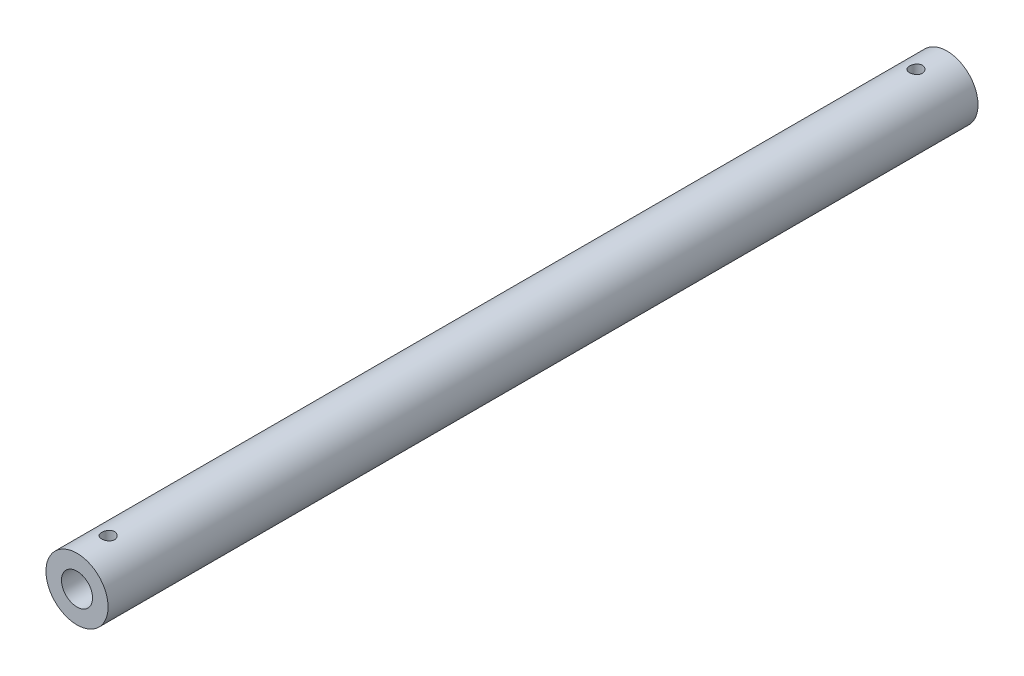
ISO-10303-21;
HEADER;
FILE_DESCRIPTION(('STEP AP214'),'2;1');
FILE_NAME('part.step','',(''),(''),'','','');
FILE_SCHEMA(('AUTOMOTIVE_DESIGN { 1 0 10303 214 1 1 1 1 }'));
ENDSEC;
DATA;
#1=APPLICATION_CONTEXT('core data for automotive mechanical design processes');
#2=APPLICATION_PROTOCOL_DEFINITION('international standard','automotive_design',2000,#1);
#3=PRODUCT_CONTEXT('',#1,'mechanical');
#4=PRODUCT('Part','Part','',(#3));
#5=PRODUCT_RELATED_PRODUCT_CATEGORY('part','',(#4));
#6=PRODUCT_DEFINITION_FORMATION('','',#4);
#7=PRODUCT_DEFINITION_CONTEXT('part definition',#1,'design');
#8=PRODUCT_DEFINITION('design','',#6,#7);
#9=PRODUCT_DEFINITION_SHAPE('','',#8);
#10=(LENGTH_UNIT() NAMED_UNIT(*) SI_UNIT(.MILLI.,.METRE.));
#11=(NAMED_UNIT(*) PLANE_ANGLE_UNIT() SI_UNIT($,.RADIAN.));
#12=(NAMED_UNIT(*) SI_UNIT($,.STERADIAN.) SOLID_ANGLE_UNIT());
#13=UNCERTAINTY_MEASURE_WITH_UNIT(LENGTH_MEASURE(1.E-05),#10,'distance_accuracy_value','');
#14=(GEOMETRIC_REPRESENTATION_CONTEXT(3) GLOBAL_UNCERTAINTY_ASSIGNED_CONTEXT((#13)) GLOBAL_UNIT_ASSIGNED_CONTEXT((#10,
#11,#12)) REPRESENTATION_CONTEXT('',''));
#15=CARTESIAN_POINT('',(0.,0.,0.));
#16=DIRECTION('',(0.,0.,1.));
#17=DIRECTION('',(1.,0.,0.));
#18=AXIS2_PLACEMENT_3D('',#15,#16,#17);
#19=CARTESIAN_POINT('',(0.,0.,-210.));
#20=DIRECTION('',(0.,0.,1.));
#21=DIRECTION('',(1.,0.,0.));
#22=AXIS2_PLACEMENT_3D('',#19,#20,#21);
#23=CYLINDRICAL_SURFACE('',#22,15.);
#24=CARTESIAN_POINT('',(0.,15.,191.9));
#25=CARTESIAN_POINT('',(-0.172165692568075,14.9999968145247,191.90000618457));
#26=CARTESIAN_POINT('',(-0.344408344623985,14.997005579049,191.914390881014));
#27=CARTESIAN_POINT('',(-0.6840167687517,14.9853616038391,191.971499057615));
#28=CARTESIAN_POINT('',(-0.851378698493531,14.9767045230125,192.014244267549));
#29=CARTESIAN_POINT('',(-1.17626714760312,14.9546945810427,192.126689905818));
#30=CARTESIAN_POINT('',(-1.33380320695702,14.9413463608244,192.196363700585));
#31=CARTESIAN_POINT('',(-1.63494054093474,14.9114015957254,192.360607679373));
#32=CARTESIAN_POINT('',(-1.77854248092075,14.8948052060611,192.455176673833));
#33=CARTESIAN_POINT('',(-2.0498140026125,14.8599203077403,192.667970705814));
#34=CARTESIAN_POINT('',(-2.17725387792713,14.841612714398,192.78648547387));
#35=CARTESIAN_POINT('',(-2.41059374938868,14.8055061029318,193.043184305505));
#36=CARTESIAN_POINT('',(-2.51649198363873,14.7877071265103,193.181369976402));
#37=CARTESIAN_POINT('',(-2.70473262746811,14.7544460628154,193.475156332992));
#38=CARTESIAN_POINT('',(-2.78683486689837,14.7390084976833,193.630913928046));
#39=CARTESIAN_POINT('',(-2.92361365563604,14.7124902368737,193.954385744112));
#40=CARTESIAN_POINT('',(-2.97829310959917,14.7014090797868,194.122098696646));
#41=CARTESIAN_POINT('',(-3.05792378241659,14.6850518417562,194.462241853876));
#42=CARTESIAN_POINT('',(-3.08327931876006,14.6796968878264,194.634573532448));
#43=CARTESIAN_POINT('',(-3.1047987188951,14.6751611480918,194.981121638894));
#44=CARTESIAN_POINT('',(-3.10096577486346,14.6759796871273,195.155337858587));
#45=CARTESIAN_POINT('',(-3.06454338331475,14.6836268744082,195.497735233949));
#46=CARTESIAN_POINT('',(-3.03241955530402,14.6903582036209,195.665968419241));
#47=CARTESIAN_POINT('',(-2.94106317686199,14.7089190681247,195.994604990454));
#48=CARTESIAN_POINT('',(-2.88182925294598,14.7207488617187,196.155007979217));
#49=CARTESIAN_POINT('',(-2.73749545783407,14.7482719850807,196.464761349049));
#50=CARTESIAN_POINT('',(-2.65221295005861,14.7639924411575,196.614024117796));
#51=CARTESIAN_POINT('',(-2.45833155039526,14.7975084496401,196.896294231118));
#52=CARTESIAN_POINT('',(-2.34972980522963,14.8153042558583,197.029299583353));
#53=CARTESIAN_POINT('',(-2.10980951412047,14.8513860400371,197.277964018986));
#54=CARTESIAN_POINT('',(-1.97809406671112,14.8696748609556,197.393240085605));
#55=CARTESIAN_POINT('',(-1.69699917981561,14.9043690302707,197.600124474423));
#56=CARTESIAN_POINT('',(-1.54761948341342,14.920774351266,197.69173245232));
#57=CARTESIAN_POINT('',(-1.23499644988396,14.949897695655,197.848759280562));
#58=CARTESIAN_POINT('',(-1.0717293661543,14.9626092321176,197.914132133225));
#59=CARTESIAN_POINT('',(-0.736208050305237,14.9828639201261,198.016412723749));
#60=CARTESIAN_POINT('',(-0.563954985205533,14.9904077410196,198.05332414815));
#61=CARTESIAN_POINT('',(-0.218640650723563,14.9993830838028,198.097086713271));
#62=CARTESIAN_POINT('',(-0.0456484522188012,15.0009211054796,198.104461679909));
#63=CARTESIAN_POINT('',(0.299096179156921,14.9980082795858,198.090355851714));
#64=CARTESIAN_POINT('',(0.470848686046561,14.9935577925971,198.068876794247));
#65=CARTESIAN_POINT('',(0.806532778422362,14.9792348501822,197.99810756781));
#66=CARTESIAN_POINT('',(0.970523916752335,14.9694152228943,197.949088246188));
#67=CARTESIAN_POINT('',(1.28795822388415,14.9454516233604,197.824927550587));
#68=CARTESIAN_POINT('',(1.44140056223108,14.9313073111298,197.749784122801));
#69=CARTESIAN_POINT('',(1.73557589191958,14.899998810058,197.574389568514));
#70=CARTESIAN_POINT('',(1.87611842957524,14.8827978643853,197.473825711686));
#71=CARTESIAN_POINT('',(2.13852141882692,14.8473663952166,197.250861250337));
#72=CARTESIAN_POINT('',(2.26037971863337,14.8291357534649,197.128458134182));
#73=CARTESIAN_POINT('',(2.48399401838079,14.7933375094228,196.862898224027));
#74=CARTESIAN_POINT('',(2.58538928856013,14.7757855941988,196.719435189048));
#75=CARTESIAN_POINT('',(2.76264557446454,14.7436744809272,196.417206821806));
#76=CARTESIAN_POINT('',(2.83850764553234,14.7291151591989,196.258442122345));
#77=CARTESIAN_POINT('',(2.96206237859333,14.704766460738,195.930938691601));
#78=CARTESIAN_POINT('',(3.00990595506134,14.6949515802098,195.76225888235));
#79=CARTESIAN_POINT('',(3.07651834817521,14.681151621117,195.419028213839));
#80=CARTESIAN_POINT('',(3.09529124863372,14.6771657237085,195.244478182742));
#81=CARTESIAN_POINT('',(3.10307030783304,14.6755226409731,194.898088801353));
#82=CARTESIAN_POINT('',(3.09264711298509,14.6777441283759,194.726262590665));
#83=CARTESIAN_POINT('',(3.04359493211143,14.6879932817592,194.386870134022));
#84=CARTESIAN_POINT('',(3.00496620761724,14.6960208939033,194.219303848583));
#85=CARTESIAN_POINT('',(2.90086151532538,14.716921819634,193.893582191028));
#86=CARTESIAN_POINT('',(2.83546006555444,14.7297816752769,193.735402081932));
#87=CARTESIAN_POINT('',(2.67973384395482,14.7589049039727,193.432172077593));
#88=CARTESIAN_POINT('',(2.58940680339969,14.7751685868093,193.287123379167));
#89=CARTESIAN_POINT('',(2.38446392361929,14.809635154064,193.011441834902));
#90=CARTESIAN_POINT('',(2.26943782754736,14.8278678241242,192.881117642797));
#91=CARTESIAN_POINT('',(2.01920377162768,14.8640090653401,192.64143294543));
#92=CARTESIAN_POINT('',(1.88399117387353,14.8819175609528,192.53207727097));
#93=CARTESIAN_POINT('',(1.59538198786284,14.9156320795551,192.336259613768));
#94=CARTESIAN_POINT('',(1.44179699181802,14.931412025711,192.250070618688));
#95=CARTESIAN_POINT('',(1.12203522871779,14.9588332815734,192.104863888172));
#96=CARTESIAN_POINT('',(0.955869690892327,14.9704782304995,192.045822246729));
#97=CARTESIAN_POINT('',(0.657833295489253,14.9861185683186,191.96770728621));
#98=CARTESIAN_POINT('',(0.527631279793751,14.9912930325766,191.942363403325));
#99=CARTESIAN_POINT('',(0.264967984387544,14.9982349131395,191.908507682225));
#100=CARTESIAN_POINT('',(0.132506785912507,15.0000024516911,191.899995240065));
#101=CARTESIAN_POINT('',(0.,15.,191.9));
#102=B_SPLINE_CURVE_WITH_KNOTS('',3,(#24,#25,#26,#27,#28,#29,#30,#31,#32,#33,#34,#35,#36,#37,
#38,#39,#40,#41,#42,#43,#44,#45,#46,#47,#48,#49,#50,#51,#52,#53,#54,#55,#56,#57,#58,#59,#60,#61,
#62,#63,#64,#65,#66,#67,#68,#69,#70,#71,#72,#73,#74,#75,#76,#77,#78,#79,#80,#81,#82,#83,#84,#85,
#86,#87,#88,#89,#90,#91,#92,#93,#94,#95,#96,#97,#98,#99,#100,#101),.UNSPECIFIED.,.T.,.F.,(4,2,2,
2,2,2,2,2,2,2,2,2,2,2,2,2,2,2,2,2,2,2,2,2,2,2,2,2,2,2,2,2,2,2,2,2,2,2,4),(0.,0.516012233354276,
1.03242029170924,1.54831890115688,2.06419286401491,2.58672901286762,3.10930788292938,
3.63699074660939,4.16461770564988,4.68487960325835,5.20508460362237,5.71688465009023,
6.22871062886656,6.74421096019477,7.25977440270464,7.78525818005798,8.31074960120178,
8.83715837566194,9.36349895418801,9.88046246952418,10.3973948586867,10.9093302438091,
11.4213058850333,11.9399157526589,12.4585853017375,12.9857239359749,13.5128407797481,
14.0370916901281,14.5612689477046,15.0752728884932,15.5892720633185,16.1018502189675,
16.6144750448609,17.1363837856733,17.6584126215689,18.1863470781733,18.7138157401919,
19.1109771901377,19.5081243889402),.UNSPECIFIED.);
#103=CARTESIAN_POINT('',(0.,15.,191.9));
#104=VERTEX_POINT('',#103);
#105=EDGE_CURVE('E74',#104,#104,#102,.T.);
#106=ORIENTED_EDGE('',*,*,#105,.F.);
#107=EDGE_LOOP('',(#106));
#108=FACE_BOUND('',#107,.T.);
#109=CARTESIAN_POINT('',(0.,0.,210.));
#110=DIRECTION('',(0.,0.,1.));
#111=DIRECTION('',(1.,0.,0.));
#112=AXIS2_PLACEMENT_3D('',#109,#110,#111);
#113=CIRCLE('',#112,15.);
#114=CARTESIAN_POINT('',(15.,0.,210.));
#115=VERTEX_POINT('',#114);
#116=EDGE_CURVE('E63',#115,#115,#113,.T.);
#117=ORIENTED_EDGE('',*,*,#116,.F.);
#118=EDGE_LOOP('',(#117));
#119=FACE_BOUND('',#118,.T.);
#120=CARTESIAN_POINT('',(0.,0.,-210.));
#121=DIRECTION('',(0.,0.,1.));
#122=DIRECTION('',(1.,0.,0.));
#123=AXIS2_PLACEMENT_3D('',#120,#121,#122);
#124=CIRCLE('',#123,15.);
#125=CARTESIAN_POINT('',(15.,0.,-210.));
#126=VERTEX_POINT('',#125);
#127=EDGE_CURVE('E10',#126,#126,#124,.T.);
#128=ORIENTED_EDGE('',*,*,#127,.T.);
#129=EDGE_LOOP('',(#128));
#130=FACE_BOUND('',#129,.T.);
#131=CARTESIAN_POINT('',(0.,15.,-198.1));
#132=CARTESIAN_POINT('',(0.172165692568075,14.9999968145247,-198.09999381543));
#133=CARTESIAN_POINT('',(0.344408344623984,14.997005579049,-198.085609118986));
#134=CARTESIAN_POINT('',(0.684016768751701,14.9853616038391,-198.028500942385));
#135=CARTESIAN_POINT('',(0.851378698493532,14.9767045230125,-197.985755732451));
#136=CARTESIAN_POINT('',(1.17626714760312,14.9546945810427,-197.873310094182));
#137=CARTESIAN_POINT('',(1.33380320695701,14.9413463608244,-197.803636299415));
#138=CARTESIAN_POINT('',(1.63494054093473,14.9114015957254,-197.639392320627));
#139=CARTESIAN_POINT('',(1.77854248092075,14.8948052060611,-197.544823326167));
#140=CARTESIAN_POINT('',(2.0498140026125,14.8599203077403,-197.332029294186));
#141=CARTESIAN_POINT('',(2.17725387792713,14.841612714398,-197.21351452613));
#142=CARTESIAN_POINT('',(2.41059374938868,14.8055061029318,-196.956815694495));
#143=CARTESIAN_POINT('',(2.51649198363873,14.7877071265103,-196.818630023598));
#144=CARTESIAN_POINT('',(2.70473262746811,14.7544460628154,-196.524843667008));
#145=CARTESIAN_POINT('',(2.78683486689837,14.7390084976833,-196.369086071954));
#146=CARTESIAN_POINT('',(2.92361365563604,14.7124902368737,-196.045614255889));
#147=CARTESIAN_POINT('',(2.97829310959917,14.7014090797868,-195.877901303354));
#148=CARTESIAN_POINT('',(3.05792378241659,14.6850518417562,-195.537758146124));
#149=CARTESIAN_POINT('',(3.08327931876006,14.6796968878264,-195.365426467552));
#150=CARTESIAN_POINT('',(3.1047987188951,14.6751611480918,-195.018878361106));
#151=CARTESIAN_POINT('',(3.10096577486346,14.6759796871273,-194.844662141413));
#152=CARTESIAN_POINT('',(3.06454338331475,14.6836268744082,-194.502264766051));
#153=CARTESIAN_POINT('',(3.03241955530402,14.6903582036209,-194.334031580759));
#154=CARTESIAN_POINT('',(2.94106317686199,14.7089190681247,-194.005395009546));
#155=CARTESIAN_POINT('',(2.88182925294598,14.7207488617187,-193.844992020783));
#156=CARTESIAN_POINT('',(2.73749545783407,14.7482719850807,-193.535238650951));
#157=CARTESIAN_POINT('',(2.65221295005861,14.7639924411575,-193.385975882204));
#158=CARTESIAN_POINT('',(2.45833155039526,14.7975084496401,-193.103705768882));
#159=CARTESIAN_POINT('',(2.34972980522964,14.8153042558583,-192.970700416647));
#160=CARTESIAN_POINT('',(2.10980951412048,14.8513860400371,-192.722035981014));
#161=CARTESIAN_POINT('',(1.97809406671112,14.8696748609556,-192.606759914395));
#162=CARTESIAN_POINT('',(1.69699917981561,14.9043690302707,-192.399875525577));
#163=CARTESIAN_POINT('',(1.54761948341342,14.920774351266,-192.30826754768));
#164=CARTESIAN_POINT('',(1.23499644988396,14.949897695655,-192.151240719438));
#165=CARTESIAN_POINT('',(1.07172936615429,14.9626092321176,-192.085867866775));
#166=CARTESIAN_POINT('',(0.736208050305234,14.9828639201261,-191.983587276251));
#167=CARTESIAN_POINT('',(0.56395498520553,14.9904077410196,-191.94667585185));
#168=CARTESIAN_POINT('',(0.21864065072356,14.9993830838028,-191.902913286729));
#169=CARTESIAN_POINT('',(0.0456484522187993,15.0009211054796,-191.895538320091));
#170=CARTESIAN_POINT('',(-0.299096179156922,14.9980082795858,-191.909644148286));
#171=CARTESIAN_POINT('',(-0.470848686046561,14.9935577925971,-191.931123205753));
#172=CARTESIAN_POINT('',(-0.806532778422362,14.9792348501822,-192.001892432191));
#173=CARTESIAN_POINT('',(-0.970523916752336,14.9694152228943,-192.050911753812));
#174=CARTESIAN_POINT('',(-1.28795822388415,14.9454516233604,-192.175072449413));
#175=CARTESIAN_POINT('',(-1.44140056223108,14.9313073111298,-192.250215877199));
#176=CARTESIAN_POINT('',(-1.73557589191957,14.899998810058,-192.425610431486));
#177=CARTESIAN_POINT('',(-1.87611842957523,14.8827978643853,-192.526174288314));
#178=CARTESIAN_POINT('',(-2.13852141882691,14.8473663952166,-192.749138749663));
#179=CARTESIAN_POINT('',(-2.26037971863336,14.8291357534649,-192.871541865818));
#180=CARTESIAN_POINT('',(-2.48399401838079,14.7933375094228,-193.137101775973));
#181=CARTESIAN_POINT('',(-2.58538928856013,14.7757855941988,-193.280564810952));
#182=CARTESIAN_POINT('',(-2.76264557446454,14.7436744809272,-193.582793178194));
#183=CARTESIAN_POINT('',(-2.83850764553234,14.7291151591989,-193.741557877655));
#184=CARTESIAN_POINT('',(-2.96206237859333,14.704766460738,-194.069061308399));
#185=CARTESIAN_POINT('',(-3.00990595506134,14.6949515802098,-194.237741117651));
#186=CARTESIAN_POINT('',(-3.07651834817521,14.681151621117,-194.580971786161));
#187=CARTESIAN_POINT('',(-3.09529124863372,14.6771657237085,-194.755521817258));
#188=CARTESIAN_POINT('',(-3.10307030783304,14.6755226409731,-195.101911198647));
#189=CARTESIAN_POINT('',(-3.09264711298509,14.6777441283759,-195.273737409335));
#190=CARTESIAN_POINT('',(-3.04359493211143,14.6879932817592,-195.613129865978));
#191=CARTESIAN_POINT('',(-3.00496620761724,14.6960208939033,-195.780696151417));
#192=CARTESIAN_POINT('',(-2.90086151532537,14.716921819634,-196.106417808972));
#193=CARTESIAN_POINT('',(-2.83546006555443,14.7297816752769,-196.264597918068));
#194=CARTESIAN_POINT('',(-2.67973384395481,14.7589049039727,-196.567827922407));
#195=CARTESIAN_POINT('',(-2.58940680339968,14.7751685868093,-196.712876620833));
#196=CARTESIAN_POINT('',(-2.38446392361929,14.809635154064,-196.988558165098));
#197=CARTESIAN_POINT('',(-2.26943782754736,14.8278678241242,-197.118882357203));
#198=CARTESIAN_POINT('',(-2.01920377162768,14.8640090653401,-197.35856705457));
#199=CARTESIAN_POINT('',(-1.88399117387353,14.8819175609528,-197.46792272903));
#200=CARTESIAN_POINT('',(-1.59538198786284,14.9156320795551,-197.663740386232));
#201=CARTESIAN_POINT('',(-1.44179699181802,14.931412025711,-197.749929381312));
#202=CARTESIAN_POINT('',(-1.12203522871779,14.9588332815734,-197.895136111828));
#203=CARTESIAN_POINT('',(-0.955869690892327,14.9704782304995,-197.954177753271));
#204=CARTESIAN_POINT('',(-0.657833295489253,14.9861185683186,-198.03229271379));
#205=CARTESIAN_POINT('',(-0.527631279793751,14.9912930325766,-198.057636596675));
#206=CARTESIAN_POINT('',(-0.264967984387544,14.9982349131395,-198.091492317775));
#207=CARTESIAN_POINT('',(-0.132506785912507,15.0000024516911,-198.100004759935));
#208=CARTESIAN_POINT('',(0.,15.,-198.1));
#209=B_SPLINE_CURVE_WITH_KNOTS('',3,(#131,#132,#133,#134,#135,#136,#137,#138,#139,#140,#141,
#142,#143,#144,#145,#146,#147,#148,#149,#150,#151,#152,#153,#154,#155,#156,#157,#158,#159,#160,
#161,#162,#163,#164,#165,#166,#167,#168,#169,#170,#171,#172,#173,#174,#175,#176,#177,#178,#179,
#180,#181,#182,#183,#184,#185,#186,#187,#188,#189,#190,#191,#192,#193,#194,#195,#196,#197,#198,
#199,#200,#201,#202,#203,#204,#205,#206,#207,#208),.UNSPECIFIED.,.T.,.F.,(4,2,2,2,2,2,2,2,2,2,2,
2,2,2,2,2,2,2,2,2,2,2,2,2,2,2,2,2,2,2,2,2,2,2,2,2,2,2,4),(0.,0.516012233354276,1.03242029170924,
1.54831890115687,2.06419286401491,2.58672901286762,3.10930788292938,3.63699074660939,
4.16461770564988,4.68487960325835,5.20508460362237,5.71688465009023,6.22871062886655,
6.74421096019477,7.25977440270464,7.78525818005795,8.31074960120177,8.83715837566196,
9.36349895418801,9.88046246952418,10.3973948586867,10.9093302438091,11.4213058850333,
11.9399157526589,12.4585853017375,12.9857239359749,13.5128407797481,14.0370916901281,
14.5612689477046,15.0752728884932,15.5892720633185,16.1018502189676,16.6144750448609,
17.1363837856733,17.6584126215689,18.1863470781733,18.7138157401919,19.1109771901377,
19.5081243889402),.UNSPECIFIED.);
#210=CARTESIAN_POINT('',(0.,15.,-198.1));
#211=VERTEX_POINT('',#210);
#212=EDGE_CURVE('E73',#211,#211,#209,.T.);
#213=ORIENTED_EDGE('',*,*,#212,.T.);
#214=EDGE_LOOP('',(#213));
#215=FACE_BOUND('',#214,.T.);
#216=ADVANCED_FACE('F43',(#108,#119,#130,#215),#23,.T.);
#217=CARTESIAN_POINT('',(0.,0.,-210.));
#218=DIRECTION('',(0.,0.,1.));
#219=DIRECTION('',(1.,0.,0.));
#220=AXIS2_PLACEMENT_3D('',#217,#218,#219);
#221=CYLINDRICAL_SURFACE('',#220,7.5);
#222=CARTESIAN_POINT('',(0.,7.5,191.9));
#223=CARTESIAN_POINT('',(-0.166153002613096,7.49999499657015,191.900006439139));
#224=CARTESIAN_POINT('',(-0.332600464403828,7.49441556709234,191.913437102607));
#225=CARTESIAN_POINT('',(-0.660768761003523,7.47265556326767,191.966659456979));
#226=CARTESIAN_POINT('',(-0.822475981409231,7.4564470859861,192.00652053498));
#227=CARTESIAN_POINT('',(-1.13589928883872,7.41516232897275,192.110897830234));
#228=CARTESIAN_POINT('',(-1.28764700409263,7.39011591076245,192.175331081826));
#229=CARTESIAN_POINT('',(-1.57803340286612,7.33360222650622,192.32668057778));
#230=CARTESIAN_POINT('',(-1.71667615552021,7.30213696318032,192.413589811752));
#231=CARTESIAN_POINT('',(-1.98400959910197,7.23419554679821,192.61197764626));
#232=CARTESIAN_POINT('',(-2.11196525773685,7.19755699911941,192.724390668417));
#233=CARTESIAN_POINT('',(-2.34783768718456,7.12411042208018,192.968619929221));
#234=CARTESIAN_POINT('',(-2.45574406182104,7.0873023148786,193.100446171071));
#235=CARTESIAN_POINT('',(-2.6535947314415,7.01570032840253,193.387471400951));
#236=CARTESIAN_POINT('',(-2.74242148647984,6.98108925988135,193.543491095404));
#237=CARTESIAN_POINT('',(-2.89224243961144,6.9203697427042,193.869896741966));
#238=CARTESIAN_POINT('',(-2.9532507497489,6.89425698486144,194.040275357834));
#239=CARTESIAN_POINT('',(-3.04268024888774,6.8552453498953,194.382104091265));
#240=CARTESIAN_POINT('',(-3.07251470951095,6.84177651513845,194.553116939132));
#241=CARTESIAN_POINT('',(-3.10316007729673,6.82793602371857,194.898211058538));
#242=CARTESIAN_POINT('',(-3.10398662811009,6.82755730769831,195.072290625546));
#243=CARTESIAN_POINT('',(-3.07765851268915,6.83945669009682,195.404603117149));
#244=CARTESIAN_POINT('',(-3.05260360053316,6.85078502883839,195.563043193012));
#245=CARTESIAN_POINT('',(-2.97874158057689,6.88321931438638,195.873228128714));
#246=CARTESIAN_POINT('',(-2.92993000846889,6.90432709889237,196.024971724314));
#247=CARTESIAN_POINT('',(-2.80899254802325,6.95441629953129,196.32125495533));
#248=CARTESIAN_POINT('',(-2.73639615555451,6.98355455159123,196.465574835102));
#249=CARTESIAN_POINT('',(-2.57028194875633,7.04638370508448,196.740539248003));
#250=CARTESIAN_POINT('',(-2.47675595937095,7.0800763834253,196.871178408124));
#251=CARTESIAN_POINT('',(-2.26231791362187,7.15162260147758,197.12649017387));
#252=CARTESIAN_POINT('',(-2.13977666022388,7.18958932893573,197.249766523274));
#253=CARTESIAN_POINT('',(-1.87537753928264,7.26304146095989,197.47448333847));
#254=CARTESIAN_POINT('',(-1.73351530071415,7.29852630128623,197.575918849724));
#255=CARTESIAN_POINT('',(-1.43031567972321,7.3640172601883,197.756077758159));
#256=CARTESIAN_POINT('',(-1.2686134301535,7.3938829557076,197.834241913309));
#257=CARTESIAN_POINT('',(-0.932805541489827,7.44369617955768,197.961770039552));
#258=CARTESIAN_POINT('',(-0.758706702716549,7.46364909848067,198.011149666282));
#259=CARTESIAN_POINT('',(-0.41472327104277,7.49038660533013,198.076804702462));
#260=CARTESIAN_POINT('',(-0.24525418833905,7.49791555875999,198.094954434622));
#261=CARTESIAN_POINT('',(0.0944609767199216,7.50132646954416,198.103211537545));
#262=CARTESIAN_POINT('',(0.264706827033569,7.4972117034244,198.093326797167));
#263=CARTESIAN_POINT('',(0.592423142194307,7.4782813005357,198.047145000089));
#264=CARTESIAN_POINT('',(0.750112133817265,7.46399615818736,198.012156687961));
#265=CARTESIAN_POINT('',(1.05721523253206,7.42672470407196,197.918574109654));
#266=CARTESIAN_POINT('',(1.20662828750662,7.40373728888471,197.859976849877));
#267=CARTESIAN_POINT('',(1.49816127489848,7.35038535240201,197.718924328521));
#268=CARTESIAN_POINT('',(1.63991168325742,7.31981428517996,197.635785962502));
#269=CARTESIAN_POINT('',(1.90795528937434,7.25456871961595,197.448763178137));
#270=CARTESIAN_POINT('',(2.03424204531875,7.21989252291917,197.344870160969));
#271=CARTESIAN_POINT('',(2.27711097618432,7.14716389966532,197.11072920737));
#272=CARTESIAN_POINT('',(2.39238480652959,7.10904560593693,196.979141117405));
#273=CARTESIAN_POINT('',(2.59957048468988,7.03593167919986,196.697866140141));
#274=CARTESIAN_POINT('',(2.69147733770028,7.00093671485367,196.548175393385));
#275=CARTESIAN_POINT('',(2.85022442048548,6.93784170380673,196.232030802691));
#276=CARTESIAN_POINT('',(2.91671570889455,6.90983935005117,196.065380814679));
#277=CARTESIAN_POINT('',(3.02013779062217,6.86527482101638,195.721731553331));
#278=CARTESIAN_POINT('',(3.05709243461338,6.84870341679441,195.544740754336));
#279=CARTESIAN_POINT('',(3.09804010789086,6.83027124265743,195.199926426674));
#280=CARTESIAN_POINT('',(3.10432447712996,6.82738831148697,195.032428294473));
#281=CARTESIAN_POINT('',(3.08985007296315,6.8339513608338,194.698868064823));
#282=CARTESIAN_POINT('',(3.06909529490485,6.84339551988095,194.532805758864));
#283=CARTESIAN_POINT('',(3.00304618929306,6.87262082828987,194.214536568116));
#284=CARTESIAN_POINT('',(2.9589003999752,6.89191674393384,194.062042558786));
#285=CARTESIAN_POINT('',(2.84843476313013,6.93829866651058,193.766584992252));
#286=CARTESIAN_POINT('',(2.78210870560485,6.96538685481484,193.623624117579));
#287=CARTESIAN_POINT('',(2.62461324834435,7.0263027906572,193.341998592494));
#288=CARTESIAN_POINT('',(2.5321991343525,7.06043592217452,193.204097378428));
#289=CARTESIAN_POINT('',(2.32690149913445,7.13072826622724,192.94504024527));
#290=CARTESIAN_POINT('',(2.21401106371446,7.16688816027646,192.823890006869));
#291=CARTESIAN_POINT('',(1.96144980129081,7.24024921308954,192.592916152182));
#292=CARTESIAN_POINT('',(1.82044465095394,7.27734125674949,192.484512756864));
#293=CARTESIAN_POINT('',(1.52076323380497,7.34580237908539,192.292812658807));
#294=CARTESIAN_POINT('',(1.3620789361027,7.37716883966076,192.209527430395));
#295=CARTESIAN_POINT('',(1.11564028430046,7.4170196735755,192.106361942525));
#296=CARTESIAN_POINT('',(1.03279444562306,7.42903456588251,192.075762581434));
#297=CARTESIAN_POINT('',(0.864502653411426,7.45049041775362,192.021673252691));
#298=CARTESIAN_POINT('',(0.77905795057013,7.45993259430366,191.998179923053));
#299=CARTESIAN_POINT('',(0.606439030534141,7.4759436159557,191.95860916377));
#300=CARTESIAN_POINT('',(0.519269667431421,7.48251958049345,191.942513353808));
#301=CARTESIAN_POINT('',(0.34374202883612,7.49263353478285,191.917844081351));
#302=CARTESIAN_POINT('',(0.255384680685456,7.49617376860472,191.909265062197));
#303=CARTESIAN_POINT('',(0.139047150358915,7.49876251103851,191.902994945568));
#304=CARTESIAN_POINT('',(0.111252100871379,7.4992261831606,191.901872324235));
#305=CARTESIAN_POINT('',(0.0556407868836706,7.4998453469052,191.900374311519));
#306=CARTESIAN_POINT('',(0.0278245223397609,7.50000083789064,191.899998921681));
#307=CARTESIAN_POINT('',(0.,7.5,191.9));
#308=B_SPLINE_CURVE_WITH_KNOTS('',3,(#222,#223,#224,#225,#226,#227,#228,#229,#230,#231,#232,
#233,#234,#235,#236,#237,#238,#239,#240,#241,#242,#243,#244,#245,#246,#247,#248,#249,#250,#251,
#252,#253,#254,#255,#256,#257,#258,#259,#260,#261,#262,#263,#264,#265,#266,#267,#268,#269,#270,
#271,#272,#273,#274,#275,#276,#277,#278,#279,#280,#281,#282,#283,#284,#285,#286,#287,#288,#289,
#290,#291,#292,#293,#294,#295,#296,#297,#298,#299,#300,#301,#302,#303,#304,#305,#306,#307),
.UNSPECIFIED.,.T.,.F.,(4,2,2,2,2,2,2,2,2,2,2,2,2,2,2,2,2,2,2,2,2,2,2,2,2,2,2,2,2,2,2,2,2,2,2,2,
2,2,2,2,2,2,4),(0.,0.498350072093011,0.998013657585997,1.49600490175053,1.99384100650711,
2.51422237468694,3.03487282828192,3.58063836896801,4.12612673889392,4.6456426340429,
5.1648783556028,5.64506306376062,6.12533804220394,6.61575367999805,7.10636120848081,
7.63770794739144,8.16917509423632,8.71253919590832,9.25560749053009,9.76477034291971,
10.2737899318644,10.758038466616,11.2423484231004,11.7416676385666,12.2411941567272,
12.7758736132641,13.310667264219,13.8525600209146,14.3940147589522,14.8943247334461,
15.394560789723,15.8722439818826,16.3500610271901,16.8563461469572,17.3628025422318,
17.9053115722873,18.448068053912,18.7151630289678,18.9821314383947,19.2484328877127,
19.5145373117832,19.5979924635494,19.6814477878343),.UNSPECIFIED.);
#309=CARTESIAN_POINT('',(0.,7.5,191.9));
#310=VERTEX_POINT('',#309);
#311=EDGE_CURVE('E47',#310,#310,#308,.T.);
#312=ORIENTED_EDGE('',*,*,#311,.T.);
#313=EDGE_LOOP('',(#312));
#314=FACE_BOUND('',#313,.T.);
#315=CARTESIAN_POINT('',(0.,0.,-210.));
#316=DIRECTION('',(0.,0.,1.));
#317=DIRECTION('',(1.,0.,0.));
#318=AXIS2_PLACEMENT_3D('',#315,#316,#317);
#319=CIRCLE('',#318,7.5);
#320=CARTESIAN_POINT('',(7.5,0.,-210.));
#321=VERTEX_POINT('',#320);
#322=EDGE_CURVE('E57',#321,#321,#319,.T.);
#323=ORIENTED_EDGE('',*,*,#322,.F.);
#324=EDGE_LOOP('',(#323));
#325=FACE_BOUND('',#324,.T.);
#326=CARTESIAN_POINT('',(0.,0.,210.));
#327=DIRECTION('',(0.,0.,1.));
#328=DIRECTION('',(1.,0.,0.));
#329=AXIS2_PLACEMENT_3D('',#326,#327,#328);
#330=CIRCLE('',#329,7.5);
#331=CARTESIAN_POINT('',(7.5,0.,210.));
#332=VERTEX_POINT('',#331);
#333=EDGE_CURVE('E94',#332,#332,#330,.T.);
#334=ORIENTED_EDGE('',*,*,#333,.T.);
#335=EDGE_LOOP('',(#334));
#336=FACE_BOUND('',#335,.T.);
#337=CARTESIAN_POINT('',(0.,7.5,-198.1));
#338=CARTESIAN_POINT('',(0.166153002613096,7.49999499657015,-198.099993560861));
#339=CARTESIAN_POINT('',(0.332600464403828,7.49441556709234,-198.086562897393));
#340=CARTESIAN_POINT('',(0.660768761003523,7.47265556326767,-198.033340543021));
#341=CARTESIAN_POINT('',(0.822475981409231,7.4564470859861,-197.99347946502));
#342=CARTESIAN_POINT('',(1.13589928883872,7.41516232897275,-197.889102169766));
#343=CARTESIAN_POINT('',(1.28764700409263,7.39011591076245,-197.824668918174));
#344=CARTESIAN_POINT('',(1.57803340286612,7.33360222650622,-197.67331942222));
#345=CARTESIAN_POINT('',(1.71667615552021,7.30213696318032,-197.586410188248));
#346=CARTESIAN_POINT('',(1.98400959910197,7.23419554679821,-197.38802235374));
#347=CARTESIAN_POINT('',(2.11196525773685,7.19755699911941,-197.275609331583));
#348=CARTESIAN_POINT('',(2.34783768718456,7.12411042208018,-197.031380070779));
#349=CARTESIAN_POINT('',(2.45574406182104,7.0873023148786,-196.899553828929));
#350=CARTESIAN_POINT('',(2.6535947314415,7.01570032840253,-196.612528599049));
#351=CARTESIAN_POINT('',(2.74242148647984,6.98108925988135,-196.456508904596));
#352=CARTESIAN_POINT('',(2.89224243961144,6.9203697427042,-196.130103258034));
#353=CARTESIAN_POINT('',(2.9532507497489,6.89425698486144,-195.959724642166));
#354=CARTESIAN_POINT('',(3.04268024888773,6.8552453498953,-195.617895908735));
#355=CARTESIAN_POINT('',(3.07251470951095,6.84177651513845,-195.446883060868));
#356=CARTESIAN_POINT('',(3.10316007729673,6.82793602371857,-195.101788941462));
#357=CARTESIAN_POINT('',(3.10398662811009,6.82755730769831,-194.927709374454));
#358=CARTESIAN_POINT('',(3.07765851268915,6.83945669009682,-194.595396882851));
#359=CARTESIAN_POINT('',(3.05260360053316,6.85078502883839,-194.436956806988));
#360=CARTESIAN_POINT('',(2.97874158057689,6.88321931438638,-194.126771871286));
#361=CARTESIAN_POINT('',(2.92993000846889,6.90432709889237,-193.975028275686));
#362=CARTESIAN_POINT('',(2.80899254802325,6.95441629953129,-193.67874504467));
#363=CARTESIAN_POINT('',(2.73639615555451,6.98355455159123,-193.534425164898));
#364=CARTESIAN_POINT('',(2.57028194875633,7.04638370508448,-193.259460751997));
#365=CARTESIAN_POINT('',(2.47675595937095,7.0800763834253,-193.128821591876));
#366=CARTESIAN_POINT('',(2.26231791362188,7.15162260147758,-192.87350982613));
#367=CARTESIAN_POINT('',(2.13977666022389,7.18958932893573,-192.750233476726));
#368=CARTESIAN_POINT('',(1.87537753928265,7.26304146095989,-192.52551666153));
#369=CARTESIAN_POINT('',(1.73351530071415,7.29852630128623,-192.424081150276));
#370=CARTESIAN_POINT('',(1.43031567972321,7.3640172601883,-192.243922241841));
#371=CARTESIAN_POINT('',(1.2686134301535,7.3938829557076,-192.165758086691));
#372=CARTESIAN_POINT('',(0.932805541489827,7.44369617955768,-192.038229960448));
#373=CARTESIAN_POINT('',(0.758706702716549,7.46364909848067,-191.988850333718));
#374=CARTESIAN_POINT('',(0.414723271042769,7.49038660533013,-191.923195297538));
#375=CARTESIAN_POINT('',(0.24525418833905,7.49791555875999,-191.905045565378));
#376=CARTESIAN_POINT('',(-0.0944609767199215,7.50132646954416,-191.896788462455));
#377=CARTESIAN_POINT('',(-0.264706827033569,7.4972117034244,-191.906673202833));
#378=CARTESIAN_POINT('',(-0.592423142194307,7.4782813005357,-191.952854999911));
#379=CARTESIAN_POINT('',(-0.750112133817265,7.46399615818736,-191.987843312039));
#380=CARTESIAN_POINT('',(-1.05721523253206,7.42672470407196,-192.081425890346));
#381=CARTESIAN_POINT('',(-1.20662828750662,7.40373728888471,-192.140023150123));
#382=CARTESIAN_POINT('',(-1.49816127489848,7.35038535240201,-192.281075671479));
#383=CARTESIAN_POINT('',(-1.63991168325742,7.31981428517996,-192.364214037498));
#384=CARTESIAN_POINT('',(-1.90795528937434,7.25456871961595,-192.551236821863));
#385=CARTESIAN_POINT('',(-2.03424204531875,7.21989252291917,-192.655129839031));
#386=CARTESIAN_POINT('',(-2.27711097618432,7.14716389966532,-192.88927079263));
#387=CARTESIAN_POINT('',(-2.39238480652959,7.10904560593693,-193.020858882595));
#388=CARTESIAN_POINT('',(-2.59957048468988,7.03593167919986,-193.302133859859));
#389=CARTESIAN_POINT('',(-2.69147733770028,7.00093671485367,-193.451824606615));
#390=CARTESIAN_POINT('',(-2.85022442048548,6.93784170380673,-193.767969197309));
#391=CARTESIAN_POINT('',(-2.91671570889455,6.90983935005117,-193.934619185321));
#392=CARTESIAN_POINT('',(-3.02013779062217,6.86527482101638,-194.278268446669));
#393=CARTESIAN_POINT('',(-3.05709243461338,6.84870341679441,-194.455259245664));
#394=CARTESIAN_POINT('',(-3.09804010789086,6.83027124265743,-194.800073573326));
#395=CARTESIAN_POINT('',(-3.10432447712996,6.82738831148697,-194.967571705527));
#396=CARTESIAN_POINT('',(-3.08985007296315,6.8339513608338,-195.301131935177));
#397=CARTESIAN_POINT('',(-3.06909529490485,6.84339551988095,-195.467194241136));
#398=CARTESIAN_POINT('',(-3.00304618929306,6.87262082828987,-195.785463431884));
#399=CARTESIAN_POINT('',(-2.9589003999752,6.89191674393384,-195.937957441214));
#400=CARTESIAN_POINT('',(-2.84843476313013,6.93829866651058,-196.233415007748));
#401=CARTESIAN_POINT('',(-2.78210870560485,6.96538685481484,-196.376375882421));
#402=CARTESIAN_POINT('',(-2.62461324834434,7.0263027906572,-196.658001407506));
#403=CARTESIAN_POINT('',(-2.53219913435248,7.06043592217453,-196.795902621572));
#404=CARTESIAN_POINT('',(-2.32690149913443,7.13072826622725,-197.05495975473));
#405=CARTESIAN_POINT('',(-2.21401106371445,7.16688816027646,-197.176109993131));
#406=CARTESIAN_POINT('',(-1.96144980129081,7.24024921308954,-197.407083847818));
#407=CARTESIAN_POINT('',(-1.82044465095395,7.27734125674949,-197.515487243136));
#408=CARTESIAN_POINT('',(-1.52076323380497,7.34580237908539,-197.707187341193));
#409=CARTESIAN_POINT('',(-1.36207893610269,7.37716883966076,-197.790472569605));
#410=CARTESIAN_POINT('',(-1.11564028430046,7.4170196735755,-197.893638057475));
#411=CARTESIAN_POINT('',(-1.03279444562306,7.42903456588251,-197.924237418566));
#412=CARTESIAN_POINT('',(-0.864502653411423,7.45049041775362,-197.978326747309));
#413=CARTESIAN_POINT('',(-0.779057950570127,7.45993259430366,-198.001820076947));
#414=CARTESIAN_POINT('',(-0.606439030534139,7.4759436159557,-198.04139083623));
#415=CARTESIAN_POINT('',(-0.519269667431421,7.48251958049345,-198.057486646192));
#416=CARTESIAN_POINT('',(-0.343742028836121,7.49263353478285,-198.082155918649));
#417=CARTESIAN_POINT('',(-0.255384680685456,7.49617376860472,-198.090734937803));
#418=CARTESIAN_POINT('',(-0.139047150358915,7.49876251103851,-198.097005054432));
#419=CARTESIAN_POINT('',(-0.111252100871379,7.4992261831606,-198.098127675765));
#420=CARTESIAN_POINT('',(-0.0556407868836706,7.4998453469052,-198.099625688481));
#421=CARTESIAN_POINT('',(-0.0278245223397609,7.50000083789064,-198.100001078319));
#422=CARTESIAN_POINT('',(0.,7.5,-198.1));
#423=B_SPLINE_CURVE_WITH_KNOTS('',3,(#337,#338,#339,#340,#341,#342,#343,#344,#345,#346,#347,
#348,#349,#350,#351,#352,#353,#354,#355,#356,#357,#358,#359,#360,#361,#362,#363,#364,#365,#366,
#367,#368,#369,#370,#371,#372,#373,#374,#375,#376,#377,#378,#379,#380,#381,#382,#383,#384,#385,
#386,#387,#388,#389,#390,#391,#392,#393,#394,#395,#396,#397,#398,#399,#400,#401,#402,#403,#404,
#405,#406,#407,#408,#409,#410,#411,#412,#413,#414,#415,#416,#417,#418,#419,#420,#421,#422),
.UNSPECIFIED.,.T.,.F.,(4,2,2,2,2,2,2,2,2,2,2,2,2,2,2,2,2,2,2,2,2,2,2,2,2,2,2,2,2,2,2,2,2,2,2,2,
2,2,2,2,2,2,4),(0.,0.498350072093011,0.998013657585997,1.49600490175053,1.99384100650711,
2.51422237468694,3.03487282828192,3.58063836896801,4.12612673889392,4.64564263404288,
5.1648783556028,5.64506306376062,6.12533804220394,6.61575367999805,7.10636120848081,
7.63770794739143,8.16917509423632,8.71253919590832,9.25560749053009,9.76477034291971,
10.2737899318644,10.758038466616,11.2423484231004,11.7416676385666,12.2411941567272,
12.7758736132641,13.310667264219,13.8525600209146,14.3940147589522,14.8943247334461,
15.394560789723,15.8722439818826,16.3500610271901,16.8563461469572,17.3628025422318,
17.9053115722873,18.448068053912,18.7151630289678,18.9821314383947,19.2484328877127,
19.5145373117832,19.5979924635494,19.6814477878343),.UNSPECIFIED.);
#424=CARTESIAN_POINT('',(0.,7.5,-198.1));
#425=VERTEX_POINT('',#424);
#426=EDGE_CURVE('E66',#425,#425,#423,.T.);
#427=ORIENTED_EDGE('',*,*,#426,.F.);
#428=EDGE_LOOP('',(#427));
#429=FACE_BOUND('',#428,.T.);
#430=ADVANCED_FACE('F75',(#314,#325,#336,#429),#221,.F.);
#431=CARTESIAN_POINT('',(0.,0.,-210.));
#432=DIRECTION('',(0.,0.,1.));
#433=DIRECTION('',(1.,0.,0.));
#434=AXIS2_PLACEMENT_3D('',#431,#432,#433);
#435=PLANE('',#434);
#436=ORIENTED_EDGE('',*,*,#322,.T.);
#437=EDGE_LOOP('',(#436));
#438=FACE_BOUND('',#437,.T.);
#439=ORIENTED_EDGE('',*,*,#127,.F.);
#440=EDGE_LOOP('',(#439));
#441=FACE_BOUND('',#440,.T.);
#442=ADVANCED_FACE('F114',(#438,#441),#435,.F.);
#443=CARTESIAN_POINT('',(0.,0.,210.));
#444=DIRECTION('',(0.,0.,1.));
#445=DIRECTION('',(1.,0.,0.));
#446=AXIS2_PLACEMENT_3D('',#443,#444,#445);
#447=PLANE('',#446);
#448=ORIENTED_EDGE('',*,*,#116,.T.);
#449=EDGE_LOOP('',(#448));
#450=FACE_BOUND('',#449,.T.);
#451=ORIENTED_EDGE('',*,*,#333,.F.);
#452=EDGE_LOOP('',(#451));
#453=FACE_BOUND('',#452,.T.);
#454=ADVANCED_FACE('F82',(#450,#453),#447,.T.);
#455=CARTESIAN_POINT('',(0.,30.,-195.));
#456=DIRECTION('',(0.,-1.,0.));
#457=DIRECTION('',(0.,0.,-1.));
#458=AXIS2_PLACEMENT_3D('',#455,#456,#457);
#459=CYLINDRICAL_SURFACE('',#458,3.09999999999999);
#460=ORIENTED_EDGE('',*,*,#212,.F.);
#461=EDGE_LOOP('',(#460));
#462=FACE_BOUND('',#461,.T.);
#463=ORIENTED_EDGE('',*,*,#426,.T.);
#464=EDGE_LOOP('',(#463));
#465=FACE_BOUND('',#464,.T.);
#466=ADVANCED_FACE('F78',(#462,#465),#459,.F.);
#467=CARTESIAN_POINT('',(0.,30.,195.));
#468=DIRECTION('',(0.,-1.,0.));
#469=DIRECTION('',(0.,0.,-1.));
#470=AXIS2_PLACEMENT_3D('',#467,#468,#469);
#471=CYLINDRICAL_SURFACE('',#470,3.09999999999999);
#472=ORIENTED_EDGE('',*,*,#105,.T.);
#473=EDGE_LOOP('',(#472));
#474=FACE_BOUND('',#473,.T.);
#475=ORIENTED_EDGE('',*,*,#311,.F.);
#476=EDGE_LOOP('',(#475));
#477=FACE_BOUND('',#476,.T.);
#478=ADVANCED_FACE('F81',(#474,#477),#471,.F.);
#479=CLOSED_SHELL('',(#216,#430,#442,#454,#466,#478));
#480=MANIFOLD_SOLID_BREP('B2',#479);
#481=ADVANCED_BREP_SHAPE_REPRESENTATION('',(#18,#480),#14);
#482=SHAPE_DEFINITION_REPRESENTATION(#9,#481);
ENDSEC;
END-ISO-10303-21;
